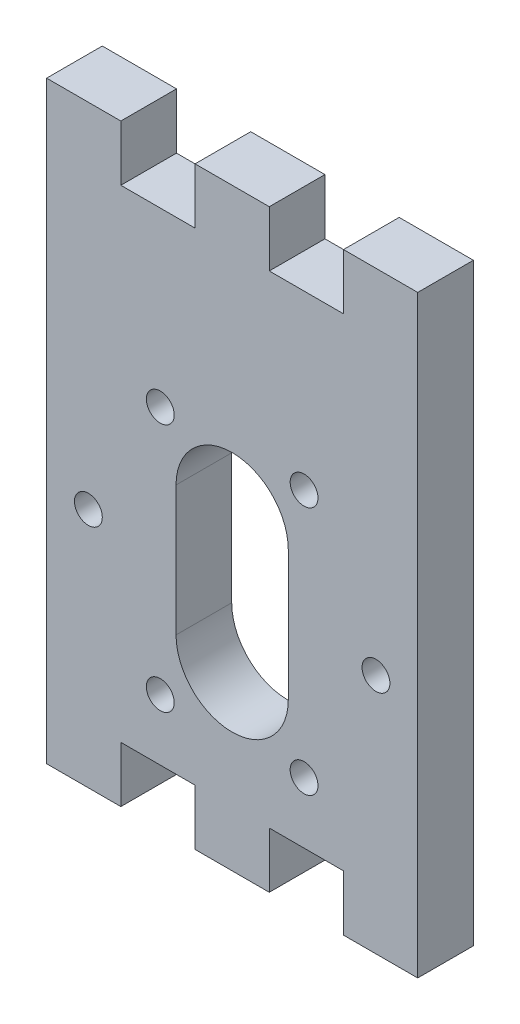
ISO-10303-21;
HEADER;
FILE_DESCRIPTION(('STEP AP214'),'2;1');
FILE_NAME('part.step','',(''),(''),'','','');
FILE_SCHEMA(('AUTOMOTIVE_DESIGN { 1 0 10303 214 1 1 1 1 }'));
ENDSEC;
DATA;
#1=APPLICATION_CONTEXT('core data for automotive mechanical design processes');
#2=APPLICATION_PROTOCOL_DEFINITION('international standard','automotive_design',2000,#1);
#3=PRODUCT_CONTEXT('',#1,'mechanical');
#4=PRODUCT('Part','Part','',(#3));
#5=PRODUCT_RELATED_PRODUCT_CATEGORY('part','',(#4));
#6=PRODUCT_DEFINITION_FORMATION('','',#4);
#7=PRODUCT_DEFINITION_CONTEXT('part definition',#1,'design');
#8=PRODUCT_DEFINITION('design','',#6,#7);
#9=PRODUCT_DEFINITION_SHAPE('','',#8);
#10=(LENGTH_UNIT() NAMED_UNIT(*) SI_UNIT(.MILLI.,.METRE.));
#11=(NAMED_UNIT(*) PLANE_ANGLE_UNIT() SI_UNIT($,.RADIAN.));
#12=(NAMED_UNIT(*) SI_UNIT($,.STERADIAN.) SOLID_ANGLE_UNIT());
#13=UNCERTAINTY_MEASURE_WITH_UNIT(LENGTH_MEASURE(1.E-05),#10,'distance_accuracy_value','');
#14=(GEOMETRIC_REPRESENTATION_CONTEXT(3) GLOBAL_UNCERTAINTY_ASSIGNED_CONTEXT((#13)) GLOBAL_UNIT_ASSIGNED_CONTEXT((#10,
#11,#12)) REPRESENTATION_CONTEXT('',''));
#15=CARTESIAN_POINT('',(0.,0.,0.));
#16=DIRECTION('',(0.,0.,1.));
#17=DIRECTION('',(1.,0.,0.));
#18=AXIS2_PLACEMENT_3D('',#15,#16,#17);
#19=CARTESIAN_POINT('',(0.,0.,6.));
#20=DIRECTION('',(0.,0.,-1.));
#21=DIRECTION('',(-1.,0.,0.));
#22=AXIS2_PLACEMENT_3D('',#19,#20,#21);
#23=PLANE('',#22);
#24=CARTESIAN_POINT('',(7.74999999999987,6.57660624134113,6.));
#25=DIRECTION('',(0.,0.,1.));
#26=DIRECTION('',(1.,0.,0.));
#27=AXIS2_PLACEMENT_3D('',#24,#25,#26);
#28=CIRCLE('',#27,1.5);
#29=CARTESIAN_POINT('',(9.24999999999987,6.57660624134113,6.));
#30=VERTEX_POINT('',#29);
#31=EDGE_CURVE('E762',#30,#30,#28,.T.);
#32=ORIENTED_EDGE('',*,*,#31,.F.);
#33=EDGE_LOOP('',(#32));
#34=FACE_BOUND('',#33,.T.);
#35=CARTESIAN_POINT('',(7.75000000000006,33.4233937586588,6.));
#36=DIRECTION('',(0.,0.,1.));
#37=DIRECTION('',(1.,0.,0.));
#38=AXIS2_PLACEMENT_3D('',#35,#36,#37);
#39=CIRCLE('',#38,1.5);
#40=CARTESIAN_POINT('',(9.25000000000006,33.4233937586588,6.));
#41=VERTEX_POINT('',#40);
#42=EDGE_CURVE('E774',#41,#41,#39,.T.);
#43=ORIENTED_EDGE('',*,*,#42,.F.);
#44=EDGE_LOOP('',(#43));
#45=FACE_BOUND('',#44,.T.);
#46=CARTESIAN_POINT('',(0.,27.,6.));
#47=DIRECTION('',(0.,0.,1.));
#48=DIRECTION('',(1.,0.,0.));
#49=AXIS2_PLACEMENT_3D('',#46,#47,#48);
#50=CIRCLE('',#49,6.05);
#51=CARTESIAN_POINT('',(6.05,27.,6.));
#52=VERTEX_POINT('',#51);
#53=CARTESIAN_POINT('',(-6.05,27.,6.));
#54=VERTEX_POINT('',#53);
#55=EDGE_CURVE('E193',#52,#54,#50,.T.);
#56=ORIENTED_EDGE('',*,*,#55,.F.);
#57=DIRECTION('',(0.,1.,0.));
#58=VECTOR('',#57,1.);
#59=CARTESIAN_POINT('',(6.05,13.,6.));
#60=LINE('',#59,#58);
#61=CARTESIAN_POINT('',(6.05,13.,6.));
#62=VERTEX_POINT('',#61);
#63=EDGE_CURVE('E216',#62,#52,#60,.T.);
#64=ORIENTED_EDGE('',*,*,#63,.F.);
#65=CARTESIAN_POINT('',(0.,13.,6.));
#66=DIRECTION('',(0.,0.,1.));
#67=DIRECTION('',(1.,0.,0.));
#68=AXIS2_PLACEMENT_3D('',#65,#66,#67);
#69=CIRCLE('',#68,6.05);
#70=CARTESIAN_POINT('',(-6.05,13.,6.));
#71=VERTEX_POINT('',#70);
#72=EDGE_CURVE('E214',#71,#62,#69,.T.);
#73=ORIENTED_EDGE('',*,*,#72,.F.);
#74=DIRECTION('',(0.,-1.,0.));
#75=VECTOR('',#74,1.);
#76=CARTESIAN_POINT('',(-6.05,27.,6.));
#77=LINE('',#76,#75);
#78=EDGE_CURVE('E201',#54,#71,#77,.T.);
#79=ORIENTED_EDGE('',*,*,#78,.F.);
#80=EDGE_LOOP('',(#56,#64,#73,#79));
#81=FACE_BOUND('',#80,.T.);
#82=DIRECTION('',(0.,-1.,0.));
#83=VECTOR('',#82,1.);
#84=CARTESIAN_POINT('',(-20.,-6.,6.));
#85=LINE('',#84,#83);
#86=CARTESIAN_POINT('',(-20.,58.,6.));
#87=VERTEX_POINT('',#86);
#88=CARTESIAN_POINT('',(-20.,-6.,6.));
#89=VERTEX_POINT('',#88);
#90=EDGE_CURVE('E238',#87,#89,#85,.T.);
#91=ORIENTED_EDGE('',*,*,#90,.T.);
#92=DIRECTION('',(1.,0.,0.));
#93=VECTOR('',#92,1.);
#94=CARTESIAN_POINT('',(-20.,-6.,6.));
#95=LINE('',#94,#93);
#96=CARTESIAN_POINT('',(-12.,-6.,6.));
#97=VERTEX_POINT('',#96);
#98=EDGE_CURVE('E241',#89,#97,#95,.T.);
#99=ORIENTED_EDGE('',*,*,#98,.T.);
#100=DIRECTION('',(0.,1.,0.));
#101=VECTOR('',#100,1.);
#102=CARTESIAN_POINT('',(-12.,0.,6.));
#103=LINE('',#102,#101);
#104=CARTESIAN_POINT('',(-12.,0.,6.));
#105=VERTEX_POINT('',#104);
#106=EDGE_CURVE('E244',#97,#105,#103,.T.);
#107=ORIENTED_EDGE('',*,*,#106,.T.);
#108=DIRECTION('',(1.,0.,0.));
#109=VECTOR('',#108,1.);
#110=CARTESIAN_POINT('',(-12.,0.,6.));
#111=LINE('',#110,#109);
#112=CARTESIAN_POINT('',(-4.,0.,6.));
#113=VERTEX_POINT('',#112);
#114=EDGE_CURVE('E246',#105,#113,#111,.T.);
#115=ORIENTED_EDGE('',*,*,#114,.T.);
#116=DIRECTION('',(0.,-1.,0.));
#117=VECTOR('',#116,1.);
#118=CARTESIAN_POINT('',(-4.,0.,6.));
#119=LINE('',#118,#117);
#120=CARTESIAN_POINT('',(-4.,-6.,6.));
#121=VERTEX_POINT('',#120);
#122=EDGE_CURVE('E248',#113,#121,#119,.T.);
#123=ORIENTED_EDGE('',*,*,#122,.T.);
#124=DIRECTION('',(1.,0.,0.));
#125=VECTOR('',#124,1.);
#126=CARTESIAN_POINT('',(4.,-6.,6.));
#127=LINE('',#126,#125);
#128=CARTESIAN_POINT('',(4.,-6.,6.));
#129=VERTEX_POINT('',#128);
#130=EDGE_CURVE('E250',#121,#129,#127,.T.);
#131=ORIENTED_EDGE('',*,*,#130,.T.);
#132=DIRECTION('',(0.,1.,0.));
#133=VECTOR('',#132,1.);
#134=CARTESIAN_POINT('',(4.,0.,6.));
#135=LINE('',#134,#133);
#136=CARTESIAN_POINT('',(4.,0.,6.));
#137=VERTEX_POINT('',#136);
#138=EDGE_CURVE('E252',#129,#137,#135,.T.);
#139=ORIENTED_EDGE('',*,*,#138,.T.);
#140=DIRECTION('',(1.,0.,0.));
#141=VECTOR('',#140,1.);
#142=CARTESIAN_POINT('',(4.,0.,6.));
#143=LINE('',#142,#141);
#144=CARTESIAN_POINT('',(12.,0.,6.));
#145=VERTEX_POINT('',#144);
#146=EDGE_CURVE('E254',#137,#145,#143,.T.);
#147=ORIENTED_EDGE('',*,*,#146,.T.);
#148=DIRECTION('',(0.,-1.,0.));
#149=VECTOR('',#148,1.);
#150=CARTESIAN_POINT('',(12.,0.,6.));
#151=LINE('',#150,#149);
#152=CARTESIAN_POINT('',(12.,-6.,6.));
#153=VERTEX_POINT('',#152);
#154=EDGE_CURVE('E256',#145,#153,#151,.T.);
#155=ORIENTED_EDGE('',*,*,#154,.T.);
#156=DIRECTION('',(1.,0.,0.));
#157=VECTOR('',#156,1.);
#158=CARTESIAN_POINT('',(20.,-6.,6.));
#159=LINE('',#158,#157);
#160=CARTESIAN_POINT('',(20.,-6.,6.));
#161=VERTEX_POINT('',#160);
#162=EDGE_CURVE('E258',#153,#161,#159,.T.);
#163=ORIENTED_EDGE('',*,*,#162,.T.);
#164=DIRECTION('',(0.,1.,0.));
#165=VECTOR('',#164,1.);
#166=CARTESIAN_POINT('',(20.,-0.999999999999998,6.));
#167=LINE('',#166,#165);
#168=CARTESIAN_POINT('',(20.,58.,6.));
#169=VERTEX_POINT('',#168);
#170=EDGE_CURVE('E260',#161,#169,#167,.T.);
#171=ORIENTED_EDGE('',*,*,#170,.T.);
#172=DIRECTION('',(-1.,0.,0.));
#173=VECTOR('',#172,1.);
#174=CARTESIAN_POINT('',(12.,58.,6.));
#175=LINE('',#174,#173);
#176=CARTESIAN_POINT('',(12.,58.,6.));
#177=VERTEX_POINT('',#176);
#178=EDGE_CURVE('E262',#169,#177,#175,.T.);
#179=ORIENTED_EDGE('',*,*,#178,.T.);
#180=DIRECTION('',(0.,-1.,0.));
#181=VECTOR('',#180,1.);
#182=CARTESIAN_POINT('',(12.,58.,6.));
#183=LINE('',#182,#181);
#184=CARTESIAN_POINT('',(12.,52.,6.));
#185=VERTEX_POINT('',#184);
#186=EDGE_CURVE('E264',#177,#185,#183,.T.);
#187=ORIENTED_EDGE('',*,*,#186,.T.);
#188=DIRECTION('',(-1.,0.,0.));
#189=VECTOR('',#188,1.);
#190=CARTESIAN_POINT('',(3.99999999999999,52.,6.));
#191=LINE('',#190,#189);
#192=CARTESIAN_POINT('',(3.99999999999999,52.,6.));
#193=VERTEX_POINT('',#192);
#194=EDGE_CURVE('E266',#185,#193,#191,.T.);
#195=ORIENTED_EDGE('',*,*,#194,.T.);
#196=DIRECTION('',(0.,1.,0.));
#197=VECTOR('',#196,1.);
#198=CARTESIAN_POINT('',(3.99999999999999,58.,6.));
#199=LINE('',#198,#197);
#200=CARTESIAN_POINT('',(3.99999999999999,58.,6.));
#201=VERTEX_POINT('',#200);
#202=EDGE_CURVE('E268',#193,#201,#199,.T.);
#203=ORIENTED_EDGE('',*,*,#202,.T.);
#204=DIRECTION('',(-1.,0.,0.));
#205=VECTOR('',#204,1.);
#206=CARTESIAN_POINT('',(-4.00000000000001,58.,6.));
#207=LINE('',#206,#205);
#208=CARTESIAN_POINT('',(-4.00000000000001,58.,6.));
#209=VERTEX_POINT('',#208);
#210=EDGE_CURVE('E270',#201,#209,#207,.T.);
#211=ORIENTED_EDGE('',*,*,#210,.T.);
#212=DIRECTION('',(0.,-1.,0.));
#213=VECTOR('',#212,1.);
#214=CARTESIAN_POINT('',(-4.00000000000001,58.,6.));
#215=LINE('',#214,#213);
#216=CARTESIAN_POINT('',(-4.00000000000001,52.,6.));
#217=VERTEX_POINT('',#216);
#218=EDGE_CURVE('E272',#209,#217,#215,.T.);
#219=ORIENTED_EDGE('',*,*,#218,.T.);
#220=DIRECTION('',(-1.,0.,0.));
#221=VECTOR('',#220,1.);
#222=CARTESIAN_POINT('',(-12.,52.,6.));
#223=LINE('',#222,#221);
#224=CARTESIAN_POINT('',(-12.,52.,6.));
#225=VERTEX_POINT('',#224);
#226=EDGE_CURVE('E274',#217,#225,#223,.T.);
#227=ORIENTED_EDGE('',*,*,#226,.T.);
#228=DIRECTION('',(0.,1.,0.));
#229=VECTOR('',#228,1.);
#230=CARTESIAN_POINT('',(-12.,58.,6.));
#231=LINE('',#230,#229);
#232=CARTESIAN_POINT('',(-12.,58.,6.));
#233=VERTEX_POINT('',#232);
#234=EDGE_CURVE('E276',#225,#233,#231,.T.);
#235=ORIENTED_EDGE('',*,*,#234,.T.);
#236=DIRECTION('',(-1.,0.,0.));
#237=VECTOR('',#236,1.);
#238=CARTESIAN_POINT('',(-20.,58.,6.));
#239=LINE('',#238,#237);
#240=EDGE_CURVE('E278',#233,#87,#239,.T.);
#241=ORIENTED_EDGE('',*,*,#240,.T.);
#242=EDGE_LOOP('',(#91,#99,#107,#115,#123,#131,#139,#147,#155,#163,#171,#179,#187,#195,#203,
#211,#219,#227,#235,#241));
#243=FACE_BOUND('',#242,.T.);
#244=CARTESIAN_POINT('',(-15.5,20.,6.));
#245=DIRECTION('',(0.,0.,1.));
#246=DIRECTION('',(1.,0.,0.));
#247=AXIS2_PLACEMENT_3D('',#244,#245,#246);
#248=CIRCLE('',#247,1.5);
#249=CARTESIAN_POINT('',(-14.,20.,6.));
#250=VERTEX_POINT('',#249);
#251=EDGE_CURVE('E232',#250,#250,#248,.T.);
#252=ORIENTED_EDGE('',*,*,#251,.F.);
#253=EDGE_LOOP('',(#252));
#254=FACE_BOUND('',#253,.T.);
#255=CARTESIAN_POINT('',(-7.74999999999998,33.4233937586588,6.));
#256=DIRECTION('',(0.,0.,1.));
#257=DIRECTION('',(1.,0.,0.));
#258=AXIS2_PLACEMENT_3D('',#255,#256,#257);
#259=CIRCLE('',#258,1.5);
#260=CARTESIAN_POINT('',(-6.24999999999997,33.4233937586588,6.));
#261=VERTEX_POINT('',#260);
#262=EDGE_CURVE('E222',#261,#261,#259,.T.);
#263=ORIENTED_EDGE('',*,*,#262,.F.);
#264=EDGE_LOOP('',(#263));
#265=FACE_BOUND('',#264,.T.);
#266=CARTESIAN_POINT('',(15.5,19.9999999999999,6.));
#267=DIRECTION('',(0.,0.,1.));
#268=DIRECTION('',(1.,0.,0.));
#269=AXIS2_PLACEMENT_3D('',#266,#267,#268);
#270=CIRCLE('',#269,1.5);
#271=CARTESIAN_POINT('',(17.,19.9999999999999,6.));
#272=VERTEX_POINT('',#271);
#273=EDGE_CURVE('E768',#272,#272,#270,.T.);
#274=ORIENTED_EDGE('',*,*,#273,.F.);
#275=EDGE_LOOP('',(#274));
#276=FACE_BOUND('',#275,.T.);
#277=CARTESIAN_POINT('',(-7.75000000000016,6.57660624134129,6.));
#278=DIRECTION('',(0.,0.,1.));
#279=DIRECTION('',(1.,0.,0.));
#280=AXIS2_PLACEMENT_3D('',#277,#278,#279);
#281=CIRCLE('',#280,1.5);
#282=CARTESIAN_POINT('',(-6.25000000000015,6.57660624134129,6.));
#283=VERTEX_POINT('',#282);
#284=EDGE_CURVE('E753',#283,#283,#281,.T.);
#285=ORIENTED_EDGE('',*,*,#284,.F.);
#286=EDGE_LOOP('',(#285));
#287=FACE_BOUND('',#286,.T.);
#288=ADVANCED_FACE('F32',(#34,#45,#81,#243,#254,#265,#276,#287),#23,.F.);
#289=CARTESIAN_POINT('',(0.,0.,0.));
#290=DIRECTION('',(0.,0.,-1.));
#291=DIRECTION('',(-1.,0.,0.));
#292=AXIS2_PLACEMENT_3D('',#289,#290,#291);
#293=PLANE('',#292);
#294=CARTESIAN_POINT('',(7.74999999999987,6.57660624134113,0.));
#295=DIRECTION('',(0.,0.,1.));
#296=DIRECTION('',(1.,0.,0.));
#297=AXIS2_PLACEMENT_3D('',#294,#295,#296);
#298=CIRCLE('',#297,1.5);
#299=CARTESIAN_POINT('',(9.24999999999987,6.57660624134113,0.));
#300=VERTEX_POINT('',#299);
#301=EDGE_CURVE('E759',#300,#300,#298,.T.);
#302=ORIENTED_EDGE('',*,*,#301,.T.);
#303=EDGE_LOOP('',(#302));
#304=FACE_BOUND('',#303,.T.);
#305=CARTESIAN_POINT('',(7.75000000000006,33.4233937586588,0.));
#306=DIRECTION('',(0.,0.,1.));
#307=DIRECTION('',(1.,0.,0.));
#308=AXIS2_PLACEMENT_3D('',#305,#306,#307);
#309=CIRCLE('',#308,1.5);
#310=CARTESIAN_POINT('',(9.25000000000006,33.4233937586588,0.));
#311=VERTEX_POINT('',#310);
#312=EDGE_CURVE('E771',#311,#311,#309,.T.);
#313=ORIENTED_EDGE('',*,*,#312,.T.);
#314=EDGE_LOOP('',(#313));
#315=FACE_BOUND('',#314,.T.);
#316=DIRECTION('',(0.,1.,0.));
#317=VECTOR('',#316,1.);
#318=CARTESIAN_POINT('',(6.05,13.,0.));
#319=LINE('',#318,#317);
#320=CARTESIAN_POINT('',(6.05,13.,0.));
#321=VERTEX_POINT('',#320);
#322=CARTESIAN_POINT('',(6.05,27.,0.));
#323=VERTEX_POINT('',#322);
#324=EDGE_CURVE('E202',#321,#323,#319,.T.);
#325=ORIENTED_EDGE('',*,*,#324,.T.);
#326=CARTESIAN_POINT('',(0.,27.,0.));
#327=DIRECTION('',(0.,0.,1.));
#328=DIRECTION('',(1.,0.,0.));
#329=AXIS2_PLACEMENT_3D('',#326,#327,#328);
#330=CIRCLE('',#329,6.05);
#331=CARTESIAN_POINT('',(-6.05,27.,0.));
#332=VERTEX_POINT('',#331);
#333=EDGE_CURVE('E55',#323,#332,#330,.T.);
#334=ORIENTED_EDGE('',*,*,#333,.T.);
#335=DIRECTION('',(0.,-1.,0.));
#336=VECTOR('',#335,1.);
#337=CARTESIAN_POINT('',(-6.05,27.,0.));
#338=LINE('',#337,#336);
#339=CARTESIAN_POINT('',(-6.05,13.,0.));
#340=VERTEX_POINT('',#339);
#341=EDGE_CURVE('E208',#332,#340,#338,.T.);
#342=ORIENTED_EDGE('',*,*,#341,.T.);
#343=CARTESIAN_POINT('',(0.,13.,0.));
#344=DIRECTION('',(0.,0.,1.));
#345=DIRECTION('',(1.,0.,0.));
#346=AXIS2_PLACEMENT_3D('',#343,#344,#345);
#347=CIRCLE('',#346,6.05);
#348=EDGE_CURVE('E224',#340,#321,#347,.T.);
#349=ORIENTED_EDGE('',*,*,#348,.T.);
#350=EDGE_LOOP('',(#325,#334,#342,#349));
#351=FACE_BOUND('',#350,.T.);
#352=DIRECTION('',(0.,-1.,0.));
#353=VECTOR('',#352,1.);
#354=CARTESIAN_POINT('',(-20.,-6.,0.));
#355=LINE('',#354,#353);
#356=CARTESIAN_POINT('',(-20.,58.,0.));
#357=VERTEX_POINT('',#356);
#358=CARTESIAN_POINT('',(-20.,-6.,0.));
#359=VERTEX_POINT('',#358);
#360=EDGE_CURVE('E235',#357,#359,#355,.T.);
#361=ORIENTED_EDGE('',*,*,#360,.F.);
#362=DIRECTION('',(-1.,0.,0.));
#363=VECTOR('',#362,1.);
#364=CARTESIAN_POINT('',(-20.,58.,0.));
#365=LINE('',#364,#363);
#366=CARTESIAN_POINT('',(-12.,58.,0.));
#367=VERTEX_POINT('',#366);
#368=EDGE_CURVE('E242',#367,#357,#365,.T.);
#369=ORIENTED_EDGE('',*,*,#368,.F.);
#370=DIRECTION('',(0.,1.,0.));
#371=VECTOR('',#370,1.);
#372=CARTESIAN_POINT('',(-12.,58.,0.));
#373=LINE('',#372,#371);
#374=CARTESIAN_POINT('',(-12.,52.,0.));
#375=VERTEX_POINT('',#374);
#376=EDGE_CURVE('E318',#375,#367,#373,.T.);
#377=ORIENTED_EDGE('',*,*,#376,.F.);
#378=DIRECTION('',(-1.,0.,0.));
#379=VECTOR('',#378,1.);
#380=CARTESIAN_POINT('',(-12.,52.,0.));
#381=LINE('',#380,#379);
#382=CARTESIAN_POINT('',(-4.00000000000001,52.,0.));
#383=VERTEX_POINT('',#382);
#384=EDGE_CURVE('E316',#383,#375,#381,.T.);
#385=ORIENTED_EDGE('',*,*,#384,.F.);
#386=DIRECTION('',(0.,-1.,0.));
#387=VECTOR('',#386,1.);
#388=CARTESIAN_POINT('',(-4.00000000000001,58.,0.));
#389=LINE('',#388,#387);
#390=CARTESIAN_POINT('',(-4.00000000000001,58.,0.));
#391=VERTEX_POINT('',#390);
#392=EDGE_CURVE('E314',#391,#383,#389,.T.);
#393=ORIENTED_EDGE('',*,*,#392,.F.);
#394=DIRECTION('',(-1.,0.,0.));
#395=VECTOR('',#394,1.);
#396=CARTESIAN_POINT('',(-4.00000000000001,58.,0.));
#397=LINE('',#396,#395);
#398=CARTESIAN_POINT('',(3.99999999999999,58.,0.));
#399=VERTEX_POINT('',#398);
#400=EDGE_CURVE('E312',#399,#391,#397,.T.);
#401=ORIENTED_EDGE('',*,*,#400,.F.);
#402=DIRECTION('',(0.,1.,0.));
#403=VECTOR('',#402,1.);
#404=CARTESIAN_POINT('',(3.99999999999999,58.,0.));
#405=LINE('',#404,#403);
#406=CARTESIAN_POINT('',(3.99999999999999,52.,0.));
#407=VERTEX_POINT('',#406);
#408=EDGE_CURVE('E310',#407,#399,#405,.T.);
#409=ORIENTED_EDGE('',*,*,#408,.F.);
#410=DIRECTION('',(-1.,0.,0.));
#411=VECTOR('',#410,1.);
#412=CARTESIAN_POINT('',(3.99999999999999,52.,0.));
#413=LINE('',#412,#411);
#414=CARTESIAN_POINT('',(12.,52.,0.));
#415=VERTEX_POINT('',#414);
#416=EDGE_CURVE('E308',#415,#407,#413,.T.);
#417=ORIENTED_EDGE('',*,*,#416,.F.);
#418=DIRECTION('',(0.,-1.,0.));
#419=VECTOR('',#418,1.);
#420=CARTESIAN_POINT('',(12.,58.,0.));
#421=LINE('',#420,#419);
#422=CARTESIAN_POINT('',(12.,58.,0.));
#423=VERTEX_POINT('',#422);
#424=EDGE_CURVE('E306',#423,#415,#421,.T.);
#425=ORIENTED_EDGE('',*,*,#424,.F.);
#426=DIRECTION('',(-1.,0.,0.));
#427=VECTOR('',#426,1.);
#428=CARTESIAN_POINT('',(12.,58.,0.));
#429=LINE('',#428,#427);
#430=CARTESIAN_POINT('',(20.,58.,0.));
#431=VERTEX_POINT('',#430);
#432=EDGE_CURVE('E304',#431,#423,#429,.T.);
#433=ORIENTED_EDGE('',*,*,#432,.F.);
#434=DIRECTION('',(0.,1.,0.));
#435=VECTOR('',#434,1.);
#436=CARTESIAN_POINT('',(20.,58.,0.));
#437=LINE('',#436,#435);
#438=CARTESIAN_POINT('',(20.,-6.,0.));
#439=VERTEX_POINT('',#438);
#440=EDGE_CURVE('E302',#439,#431,#437,.T.);
#441=ORIENTED_EDGE('',*,*,#440,.F.);
#442=DIRECTION('',(1.,0.,0.));
#443=VECTOR('',#442,1.);
#444=CARTESIAN_POINT('',(20.,-6.,0.));
#445=LINE('',#444,#443);
#446=CARTESIAN_POINT('',(12.,-6.,0.));
#447=VERTEX_POINT('',#446);
#448=EDGE_CURVE('E299',#447,#439,#445,.T.);
#449=ORIENTED_EDGE('',*,*,#448,.F.);
#450=DIRECTION('',(0.,-1.,0.));
#451=VECTOR('',#450,1.);
#452=CARTESIAN_POINT('',(12.,0.,0.));
#453=LINE('',#452,#451);
#454=CARTESIAN_POINT('',(12.,0.,0.));
#455=VERTEX_POINT('',#454);
#456=EDGE_CURVE('E297',#455,#447,#453,.T.);
#457=ORIENTED_EDGE('',*,*,#456,.F.);
#458=DIRECTION('',(1.,0.,0.));
#459=VECTOR('',#458,1.);
#460=CARTESIAN_POINT('',(4.,0.,0.));
#461=LINE('',#460,#459);
#462=CARTESIAN_POINT('',(4.,0.,0.));
#463=VERTEX_POINT('',#462);
#464=EDGE_CURVE('E295',#463,#455,#461,.T.);
#465=ORIENTED_EDGE('',*,*,#464,.F.);
#466=DIRECTION('',(0.,1.,0.));
#467=VECTOR('',#466,1.);
#468=CARTESIAN_POINT('',(4.,0.,0.));
#469=LINE('',#468,#467);
#470=CARTESIAN_POINT('',(4.,-6.,0.));
#471=VERTEX_POINT('',#470);
#472=EDGE_CURVE('E293',#471,#463,#469,.T.);
#473=ORIENTED_EDGE('',*,*,#472,.F.);
#474=DIRECTION('',(1.,0.,0.));
#475=VECTOR('',#474,1.);
#476=CARTESIAN_POINT('',(4.,-6.,0.));
#477=LINE('',#476,#475);
#478=CARTESIAN_POINT('',(-4.,-6.,0.));
#479=VERTEX_POINT('',#478);
#480=EDGE_CURVE('E291',#479,#471,#477,.T.);
#481=ORIENTED_EDGE('',*,*,#480,.F.);
#482=DIRECTION('',(0.,-1.,0.));
#483=VECTOR('',#482,1.);
#484=CARTESIAN_POINT('',(-4.,0.,0.));
#485=LINE('',#484,#483);
#486=CARTESIAN_POINT('',(-4.,0.,0.));
#487=VERTEX_POINT('',#486);
#488=EDGE_CURVE('E289',#487,#479,#485,.T.);
#489=ORIENTED_EDGE('',*,*,#488,.F.);
#490=DIRECTION('',(1.,0.,0.));
#491=VECTOR('',#490,1.);
#492=CARTESIAN_POINT('',(-12.,0.,0.));
#493=LINE('',#492,#491);
#494=CARTESIAN_POINT('',(-12.,0.,0.));
#495=VERTEX_POINT('',#494);
#496=EDGE_CURVE('E287',#495,#487,#493,.T.);
#497=ORIENTED_EDGE('',*,*,#496,.F.);
#498=DIRECTION('',(0.,1.,0.));
#499=VECTOR('',#498,1.);
#500=CARTESIAN_POINT('',(-12.,0.,0.));
#501=LINE('',#500,#499);
#502=CARTESIAN_POINT('',(-12.,-6.,0.));
#503=VERTEX_POINT('',#502);
#504=EDGE_CURVE('E285',#503,#495,#501,.T.);
#505=ORIENTED_EDGE('',*,*,#504,.F.);
#506=DIRECTION('',(1.,0.,0.));
#507=VECTOR('',#506,1.);
#508=CARTESIAN_POINT('',(-20.,-6.,0.));
#509=LINE('',#508,#507);
#510=EDGE_CURVE('E283',#359,#503,#509,.T.);
#511=ORIENTED_EDGE('',*,*,#510,.F.);
#512=EDGE_LOOP('',(#361,#369,#377,#385,#393,#401,#409,#417,#425,#433,#441,#449,#457,#465,#473,
#481,#489,#497,#505,#511));
#513=FACE_BOUND('',#512,.T.);
#514=CARTESIAN_POINT('',(-15.5,20.,0.));
#515=DIRECTION('',(0.,0.,1.));
#516=DIRECTION('',(1.,0.,0.));
#517=AXIS2_PLACEMENT_3D('',#514,#515,#516);
#518=CIRCLE('',#517,1.5);
#519=CARTESIAN_POINT('',(-14.,20.,0.));
#520=VERTEX_POINT('',#519);
#521=EDGE_CURVE('E209',#520,#520,#518,.T.);
#522=ORIENTED_EDGE('',*,*,#521,.T.);
#523=EDGE_LOOP('',(#522));
#524=FACE_BOUND('',#523,.T.);
#525=CARTESIAN_POINT('',(-7.74999999999998,33.4233937586588,0.));
#526=DIRECTION('',(0.,0.,1.));
#527=DIRECTION('',(1.,0.,0.));
#528=AXIS2_PLACEMENT_3D('',#525,#526,#527);
#529=CIRCLE('',#528,1.5);
#530=CARTESIAN_POINT('',(-6.24999999999997,33.4233937586588,0.));
#531=VERTEX_POINT('',#530);
#532=EDGE_CURVE('E777',#531,#531,#529,.T.);
#533=ORIENTED_EDGE('',*,*,#532,.T.);
#534=EDGE_LOOP('',(#533));
#535=FACE_BOUND('',#534,.T.);
#536=CARTESIAN_POINT('',(15.5,19.9999999999999,0.));
#537=DIRECTION('',(0.,0.,1.));
#538=DIRECTION('',(1.,0.,0.));
#539=AXIS2_PLACEMENT_3D('',#536,#537,#538);
#540=CIRCLE('',#539,1.5);
#541=CARTESIAN_POINT('',(17.,19.9999999999999,0.));
#542=VERTEX_POINT('',#541);
#543=EDGE_CURVE('E765',#542,#542,#540,.T.);
#544=ORIENTED_EDGE('',*,*,#543,.T.);
#545=EDGE_LOOP('',(#544));
#546=FACE_BOUND('',#545,.T.);
#547=CARTESIAN_POINT('',(-7.75000000000016,6.57660624134129,0.));
#548=DIRECTION('',(0.,0.,1.));
#549=DIRECTION('',(1.,0.,0.));
#550=AXIS2_PLACEMENT_3D('',#547,#548,#549);
#551=CIRCLE('',#550,1.5);
#552=CARTESIAN_POINT('',(-6.25000000000015,6.57660624134129,0.));
#553=VERTEX_POINT('',#552);
#554=EDGE_CURVE('E756',#553,#553,#551,.T.);
#555=ORIENTED_EDGE('',*,*,#554,.T.);
#556=EDGE_LOOP('',(#555));
#557=FACE_BOUND('',#556,.T.);
#558=ADVANCED_FACE('F384',(#304,#315,#351,#513,#524,#535,#546,#557),#293,.T.);
#559=CARTESIAN_POINT('',(-20.,-6.,6.));
#560=DIRECTION('',(1.,0.,0.));
#561=DIRECTION('',(0.,0.,-1.));
#562=AXIS2_PLACEMENT_3D('',#559,#560,#561);
#563=PLANE('',#562);
#564=ORIENTED_EDGE('',*,*,#360,.T.);
#565=DIRECTION('',(0.,0.,-1.));
#566=VECTOR('',#565,1.);
#567=CARTESIAN_POINT('',(-20.,-6.,6.));
#568=LINE('',#567,#566);
#569=EDGE_CURVE('E11',#89,#359,#568,.T.);
#570=ORIENTED_EDGE('',*,*,#569,.F.);
#571=ORIENTED_EDGE('',*,*,#90,.F.);
#572=DIRECTION('',(0.,0.,-1.));
#573=VECTOR('',#572,1.);
#574=CARTESIAN_POINT('',(-20.,58.,6.));
#575=LINE('',#574,#573);
#576=EDGE_CURVE('E280',#87,#357,#575,.T.);
#577=ORIENTED_EDGE('',*,*,#576,.T.);
#578=EDGE_LOOP('',(#564,#570,#571,#577));
#579=FACE_BOUND('',#578,.T.);
#580=ADVANCED_FACE('F34',(#579),#563,.F.);
#581=CARTESIAN_POINT('',(-20.,-6.,6.));
#582=DIRECTION('',(0.,1.,0.));
#583=DIRECTION('',(-1.,0.,0.));
#584=AXIS2_PLACEMENT_3D('',#581,#582,#583);
#585=PLANE('',#584);
#586=ORIENTED_EDGE('',*,*,#510,.T.);
#587=DIRECTION('',(0.,0.,-1.));
#588=VECTOR('',#587,1.);
#589=CARTESIAN_POINT('',(-12.,-6.,6.));
#590=LINE('',#589,#588);
#591=EDGE_CURVE('E40',#97,#503,#590,.T.);
#592=ORIENTED_EDGE('',*,*,#591,.F.);
#593=ORIENTED_EDGE('',*,*,#98,.F.);
#594=ORIENTED_EDGE('',*,*,#569,.T.);
#595=EDGE_LOOP('',(#586,#592,#593,#594));
#596=FACE_BOUND('',#595,.T.);
#597=ADVANCED_FACE('F401',(#596),#585,.F.);
#598=CARTESIAN_POINT('',(-12.,0.,6.));
#599=DIRECTION('',(-1.,0.,0.));
#600=DIRECTION('',(0.,0.,1.));
#601=AXIS2_PLACEMENT_3D('',#598,#599,#600);
#602=PLANE('',#601);
#603=ORIENTED_EDGE('',*,*,#504,.T.);
#604=DIRECTION('',(0.,0.,-1.));
#605=VECTOR('',#604,1.);
#606=CARTESIAN_POINT('',(-12.,0.,6.));
#607=LINE('',#606,#605);
#608=EDGE_CURVE('E371',#105,#495,#607,.T.);
#609=ORIENTED_EDGE('',*,*,#608,.F.);
#610=ORIENTED_EDGE('',*,*,#106,.F.);
#611=ORIENTED_EDGE('',*,*,#591,.T.);
#612=EDGE_LOOP('',(#603,#609,#610,#611));
#613=FACE_BOUND('',#612,.T.);
#614=ADVANCED_FACE('F378',(#613),#602,.F.);
#615=CARTESIAN_POINT('',(-12.,0.,6.));
#616=DIRECTION('',(0.,1.,0.));
#617=DIRECTION('',(-1.,0.,0.));
#618=AXIS2_PLACEMENT_3D('',#615,#616,#617);
#619=PLANE('',#618);
#620=ORIENTED_EDGE('',*,*,#496,.T.);
#621=DIRECTION('',(0.,0.,-1.));
#622=VECTOR('',#621,1.);
#623=CARTESIAN_POINT('',(-4.,0.,6.));
#624=LINE('',#623,#622);
#625=EDGE_CURVE('E368',#113,#487,#624,.T.);
#626=ORIENTED_EDGE('',*,*,#625,.F.);
#627=ORIENTED_EDGE('',*,*,#114,.F.);
#628=ORIENTED_EDGE('',*,*,#608,.T.);
#629=EDGE_LOOP('',(#620,#626,#627,#628));
#630=FACE_BOUND('',#629,.T.);
#631=ADVANCED_FACE('F390',(#630),#619,.F.);
#632=CARTESIAN_POINT('',(-4.,0.,6.));
#633=DIRECTION('',(1.,0.,0.));
#634=DIRECTION('',(0.,1.,0.));
#635=AXIS2_PLACEMENT_3D('',#632,#633,#634);
#636=PLANE('',#635);
#637=ORIENTED_EDGE('',*,*,#488,.T.);
#638=DIRECTION('',(0.,0.,-1.));
#639=VECTOR('',#638,1.);
#640=CARTESIAN_POINT('',(-4.,-6.,6.));
#641=LINE('',#640,#639);
#642=EDGE_CURVE('E365',#121,#479,#641,.T.);
#643=ORIENTED_EDGE('',*,*,#642,.F.);
#644=ORIENTED_EDGE('',*,*,#122,.F.);
#645=ORIENTED_EDGE('',*,*,#625,.T.);
#646=EDGE_LOOP('',(#637,#643,#644,#645));
#647=FACE_BOUND('',#646,.T.);
#648=ADVANCED_FACE('F394',(#647),#636,.F.);
#649=CARTESIAN_POINT('',(4.,-6.,6.));
#650=DIRECTION('',(0.,1.,0.));
#651=DIRECTION('',(-1.,0.,0.));
#652=AXIS2_PLACEMENT_3D('',#649,#650,#651);
#653=PLANE('',#652);
#654=ORIENTED_EDGE('',*,*,#480,.T.);
#655=DIRECTION('',(0.,0.,-1.));
#656=VECTOR('',#655,1.);
#657=CARTESIAN_POINT('',(4.,-6.,6.));
#658=LINE('',#657,#656);
#659=EDGE_CURVE('E362',#129,#471,#658,.T.);
#660=ORIENTED_EDGE('',*,*,#659,.F.);
#661=ORIENTED_EDGE('',*,*,#130,.F.);
#662=ORIENTED_EDGE('',*,*,#642,.T.);
#663=EDGE_LOOP('',(#654,#660,#661,#662));
#664=FACE_BOUND('',#663,.T.);
#665=ADVANCED_FACE('F473',(#664),#653,.F.);
#666=CARTESIAN_POINT('',(4.,0.,6.));
#667=DIRECTION('',(-1.,0.,0.));
#668=DIRECTION('',(0.,-1.,0.));
#669=AXIS2_PLACEMENT_3D('',#666,#667,#668);
#670=PLANE('',#669);
#671=ORIENTED_EDGE('',*,*,#472,.T.);
#672=DIRECTION('',(0.,0.,-1.));
#673=VECTOR('',#672,1.);
#674=CARTESIAN_POINT('',(4.,0.,6.));
#675=LINE('',#674,#673);
#676=EDGE_CURVE('E359',#137,#463,#675,.T.);
#677=ORIENTED_EDGE('',*,*,#676,.F.);
#678=ORIENTED_EDGE('',*,*,#138,.F.);
#679=ORIENTED_EDGE('',*,*,#659,.T.);
#680=EDGE_LOOP('',(#671,#677,#678,#679));
#681=FACE_BOUND('',#680,.T.);
#682=ADVANCED_FACE('F471',(#681),#670,.F.);
#683=CARTESIAN_POINT('',(4.,0.,6.));
#684=DIRECTION('',(0.,1.,0.));
#685=DIRECTION('',(-1.,0.,0.));
#686=AXIS2_PLACEMENT_3D('',#683,#684,#685);
#687=PLANE('',#686);
#688=ORIENTED_EDGE('',*,*,#464,.T.);
#689=DIRECTION('',(0.,0.,-1.));
#690=VECTOR('',#689,1.);
#691=CARTESIAN_POINT('',(12.,0.,6.));
#692=LINE('',#691,#690);
#693=EDGE_CURVE('E356',#145,#455,#692,.T.);
#694=ORIENTED_EDGE('',*,*,#693,.F.);
#695=ORIENTED_EDGE('',*,*,#146,.F.);
#696=ORIENTED_EDGE('',*,*,#676,.T.);
#697=EDGE_LOOP('',(#688,#694,#695,#696));
#698=FACE_BOUND('',#697,.T.);
#699=ADVANCED_FACE('F467',(#698),#687,.F.);
#700=CARTESIAN_POINT('',(12.,0.,6.));
#701=DIRECTION('',(1.,0.,0.));
#702=DIRECTION('',(0.,1.,0.));
#703=AXIS2_PLACEMENT_3D('',#700,#701,#702);
#704=PLANE('',#703);
#705=ORIENTED_EDGE('',*,*,#456,.T.);
#706=DIRECTION('',(0.,0.,-1.));
#707=VECTOR('',#706,1.);
#708=CARTESIAN_POINT('',(12.,-6.,6.));
#709=LINE('',#708,#707);
#710=EDGE_CURVE('E353',#153,#447,#709,.T.);
#711=ORIENTED_EDGE('',*,*,#710,.F.);
#712=ORIENTED_EDGE('',*,*,#154,.F.);
#713=ORIENTED_EDGE('',*,*,#693,.T.);
#714=EDGE_LOOP('',(#705,#711,#712,#713));
#715=FACE_BOUND('',#714,.T.);
#716=ADVANCED_FACE('F463',(#715),#704,.F.);
#717=CARTESIAN_POINT('',(20.,-6.,6.));
#718=DIRECTION('',(0.,1.,0.));
#719=DIRECTION('',(-1.,0.,0.));
#720=AXIS2_PLACEMENT_3D('',#717,#718,#719);
#721=PLANE('',#720);
#722=ORIENTED_EDGE('',*,*,#448,.T.);
#723=DIRECTION('',(0.,0.,-1.));
#724=VECTOR('',#723,1.);
#725=CARTESIAN_POINT('',(20.,-6.,6.));
#726=LINE('',#725,#724);
#727=EDGE_CURVE('E350',#161,#439,#726,.T.);
#728=ORIENTED_EDGE('',*,*,#727,.F.);
#729=ORIENTED_EDGE('',*,*,#162,.F.);
#730=ORIENTED_EDGE('',*,*,#710,.T.);
#731=EDGE_LOOP('',(#722,#728,#729,#730));
#732=FACE_BOUND('',#731,.T.);
#733=ADVANCED_FACE('F454',(#732),#721,.F.);
#734=CARTESIAN_POINT('',(20.,58.,6.));
#735=DIRECTION('',(-1.,0.,0.));
#736=DIRECTION('',(0.,-1.,0.));
#737=AXIS2_PLACEMENT_3D('',#734,#735,#736);
#738=PLANE('',#737);
#739=ORIENTED_EDGE('',*,*,#440,.T.);
#740=DIRECTION('',(0.,0.,-1.));
#741=VECTOR('',#740,1.);
#742=CARTESIAN_POINT('',(20.,58.,6.));
#743=LINE('',#742,#741);
#744=EDGE_CURVE('E347',#169,#431,#743,.T.);
#745=ORIENTED_EDGE('',*,*,#744,.F.);
#746=ORIENTED_EDGE('',*,*,#170,.F.);
#747=ORIENTED_EDGE('',*,*,#727,.T.);
#748=EDGE_LOOP('',(#739,#745,#746,#747));
#749=FACE_BOUND('',#748,.T.);
#750=ADVANCED_FACE('F458',(#749),#738,.F.);
#751=CARTESIAN_POINT('',(12.,58.,6.));
#752=DIRECTION('',(0.,-1.,0.));
#753=DIRECTION('',(0.,0.,-1.));
#754=AXIS2_PLACEMENT_3D('',#751,#752,#753);
#755=PLANE('',#754);
#756=ORIENTED_EDGE('',*,*,#432,.T.);
#757=DIRECTION('',(0.,0.,-1.));
#758=VECTOR('',#757,1.);
#759=CARTESIAN_POINT('',(12.,58.,6.));
#760=LINE('',#759,#758);
#761=EDGE_CURVE('E344',#177,#423,#760,.T.);
#762=ORIENTED_EDGE('',*,*,#761,.F.);
#763=ORIENTED_EDGE('',*,*,#178,.F.);
#764=ORIENTED_EDGE('',*,*,#744,.T.);
#765=EDGE_LOOP('',(#756,#762,#763,#764));
#766=FACE_BOUND('',#765,.T.);
#767=ADVANCED_FACE('F447',(#766),#755,.F.);
#768=CARTESIAN_POINT('',(12.,58.,6.));
#769=DIRECTION('',(1.,0.,0.));
#770=DIRECTION('',(0.,0.,-1.));
#771=AXIS2_PLACEMENT_3D('',#768,#769,#770);
#772=PLANE('',#771);
#773=ORIENTED_EDGE('',*,*,#424,.T.);
#774=DIRECTION('',(0.,0.,-1.));
#775=VECTOR('',#774,1.);
#776=CARTESIAN_POINT('',(12.,52.,6.));
#777=LINE('',#776,#775);
#778=EDGE_CURVE('E341',#185,#415,#777,.T.);
#779=ORIENTED_EDGE('',*,*,#778,.F.);
#780=ORIENTED_EDGE('',*,*,#186,.F.);
#781=ORIENTED_EDGE('',*,*,#761,.T.);
#782=EDGE_LOOP('',(#773,#779,#780,#781));
#783=FACE_BOUND('',#782,.T.);
#784=ADVANCED_FACE('F443',(#783),#772,.F.);
#785=CARTESIAN_POINT('',(3.99999999999999,52.,6.));
#786=DIRECTION('',(0.,-1.,0.));
#787=DIRECTION('',(0.,0.,-1.));
#788=AXIS2_PLACEMENT_3D('',#785,#786,#787);
#789=PLANE('',#788);
#790=ORIENTED_EDGE('',*,*,#416,.T.);
#791=DIRECTION('',(0.,0.,-1.));
#792=VECTOR('',#791,1.);
#793=CARTESIAN_POINT('',(3.99999999999999,52.,6.));
#794=LINE('',#793,#792);
#795=EDGE_CURVE('E338',#193,#407,#794,.T.);
#796=ORIENTED_EDGE('',*,*,#795,.F.);
#797=ORIENTED_EDGE('',*,*,#194,.F.);
#798=ORIENTED_EDGE('',*,*,#778,.T.);
#799=EDGE_LOOP('',(#790,#796,#797,#798));
#800=FACE_BOUND('',#799,.T.);
#801=ADVANCED_FACE('F438',(#800),#789,.F.);
#802=CARTESIAN_POINT('',(3.99999999999999,58.,6.));
#803=DIRECTION('',(-1.,0.,0.));
#804=DIRECTION('',(0.,0.,1.));
#805=AXIS2_PLACEMENT_3D('',#802,#803,#804);
#806=PLANE('',#805);
#807=ORIENTED_EDGE('',*,*,#408,.T.);
#808=DIRECTION('',(0.,0.,-1.));
#809=VECTOR('',#808,1.);
#810=CARTESIAN_POINT('',(3.99999999999999,58.,6.));
#811=LINE('',#810,#809);
#812=EDGE_CURVE('E335',#201,#399,#811,.T.);
#813=ORIENTED_EDGE('',*,*,#812,.F.);
#814=ORIENTED_EDGE('',*,*,#202,.F.);
#815=ORIENTED_EDGE('',*,*,#795,.T.);
#816=EDGE_LOOP('',(#807,#813,#814,#815));
#817=FACE_BOUND('',#816,.T.);
#818=ADVANCED_FACE('F432',(#817),#806,.F.);
#819=CARTESIAN_POINT('',(-4.00000000000001,58.,6.));
#820=DIRECTION('',(0.,-1.,0.));
#821=DIRECTION('',(0.,0.,-1.));
#822=AXIS2_PLACEMENT_3D('',#819,#820,#821);
#823=PLANE('',#822);
#824=ORIENTED_EDGE('',*,*,#400,.T.);
#825=DIRECTION('',(0.,0.,-1.));
#826=VECTOR('',#825,1.);
#827=CARTESIAN_POINT('',(-4.00000000000001,58.,6.));
#828=LINE('',#827,#826);
#829=EDGE_CURVE('E332',#209,#391,#828,.T.);
#830=ORIENTED_EDGE('',*,*,#829,.F.);
#831=ORIENTED_EDGE('',*,*,#210,.F.);
#832=ORIENTED_EDGE('',*,*,#812,.T.);
#833=EDGE_LOOP('',(#824,#830,#831,#832));
#834=FACE_BOUND('',#833,.T.);
#835=ADVANCED_FACE('F428',(#834),#823,.F.);
#836=CARTESIAN_POINT('',(-4.00000000000001,58.,6.));
#837=DIRECTION('',(1.,0.,0.));
#838=DIRECTION('',(0.,0.,-1.));
#839=AXIS2_PLACEMENT_3D('',#836,#837,#838);
#840=PLANE('',#839);
#841=ORIENTED_EDGE('',*,*,#392,.T.);
#842=DIRECTION('',(0.,0.,-1.));
#843=VECTOR('',#842,1.);
#844=CARTESIAN_POINT('',(-4.00000000000001,52.,6.));
#845=LINE('',#844,#843);
#846=EDGE_CURVE('E329',#217,#383,#845,.T.);
#847=ORIENTED_EDGE('',*,*,#846,.F.);
#848=ORIENTED_EDGE('',*,*,#218,.F.);
#849=ORIENTED_EDGE('',*,*,#829,.T.);
#850=EDGE_LOOP('',(#841,#847,#848,#849));
#851=FACE_BOUND('',#850,.T.);
#852=ADVANCED_FACE('F423',(#851),#840,.F.);
#853=CARTESIAN_POINT('',(-12.,52.,6.));
#854=DIRECTION('',(0.,-1.,0.));
#855=DIRECTION('',(0.,0.,-1.));
#856=AXIS2_PLACEMENT_3D('',#853,#854,#855);
#857=PLANE('',#856);
#858=ORIENTED_EDGE('',*,*,#384,.T.);
#859=DIRECTION('',(0.,0.,-1.));
#860=VECTOR('',#859,1.);
#861=CARTESIAN_POINT('',(-12.,52.,6.));
#862=LINE('',#861,#860);
#863=EDGE_CURVE('E326',#225,#375,#862,.T.);
#864=ORIENTED_EDGE('',*,*,#863,.F.);
#865=ORIENTED_EDGE('',*,*,#226,.F.);
#866=ORIENTED_EDGE('',*,*,#846,.T.);
#867=EDGE_LOOP('',(#858,#864,#865,#866));
#868=FACE_BOUND('',#867,.T.);
#869=ADVANCED_FACE('F417',(#868),#857,.F.);
#870=CARTESIAN_POINT('',(-12.,58.,6.));
#871=DIRECTION('',(-1.,0.,0.));
#872=DIRECTION('',(0.,0.,1.));
#873=AXIS2_PLACEMENT_3D('',#870,#871,#872);
#874=PLANE('',#873);
#875=ORIENTED_EDGE('',*,*,#376,.T.);
#876=DIRECTION('',(0.,0.,-1.));
#877=VECTOR('',#876,1.);
#878=CARTESIAN_POINT('',(-12.,58.,6.));
#879=LINE('',#878,#877);
#880=EDGE_CURVE('E323',#233,#367,#879,.T.);
#881=ORIENTED_EDGE('',*,*,#880,.F.);
#882=ORIENTED_EDGE('',*,*,#234,.F.);
#883=ORIENTED_EDGE('',*,*,#863,.T.);
#884=EDGE_LOOP('',(#875,#881,#882,#883));
#885=FACE_BOUND('',#884,.T.);
#886=ADVANCED_FACE('F413',(#885),#874,.F.);
#887=CARTESIAN_POINT('',(-20.,58.,6.));
#888=DIRECTION('',(0.,-1.,0.));
#889=DIRECTION('',(1.,0.,0.));
#890=AXIS2_PLACEMENT_3D('',#887,#888,#889);
#891=PLANE('',#890);
#892=ORIENTED_EDGE('',*,*,#368,.T.);
#893=ORIENTED_EDGE('',*,*,#576,.F.);
#894=ORIENTED_EDGE('',*,*,#240,.F.);
#895=ORIENTED_EDGE('',*,*,#880,.T.);
#896=EDGE_LOOP('',(#892,#893,#894,#895));
#897=FACE_BOUND('',#896,.T.);
#898=ADVANCED_FACE('F408',(#897),#891,.F.);
#899=CARTESIAN_POINT('',(-15.5,20.,6.));
#900=DIRECTION('',(0.,0.,-1.));
#901=DIRECTION('',(-1.,0.,0.));
#902=AXIS2_PLACEMENT_3D('',#899,#900,#901);
#903=CYLINDRICAL_SURFACE('',#902,1.5);
#904=ORIENTED_EDGE('',*,*,#251,.T.);
#905=EDGE_LOOP('',(#904));
#906=FACE_BOUND('',#905,.T.);
#907=ORIENTED_EDGE('',*,*,#521,.F.);
#908=EDGE_LOOP('',(#907));
#909=FACE_BOUND('',#908,.T.);
#910=ADVANCED_FACE('F493',(#906,#909),#903,.F.);
#911=CARTESIAN_POINT('',(0.,27.,6.));
#912=DIRECTION('',(0.,0.,-1.));
#913=DIRECTION('',(-1.,0.,0.));
#914=AXIS2_PLACEMENT_3D('',#911,#912,#913);
#915=CYLINDRICAL_SURFACE('',#914,6.05);
#916=ORIENTED_EDGE('',*,*,#333,.F.);
#917=DIRECTION('',(0.,0.,-1.));
#918=VECTOR('',#917,1.);
#919=CARTESIAN_POINT('',(6.05,27.,6.));
#920=LINE('',#919,#918);
#921=EDGE_CURVE('E197',#52,#323,#920,.T.);
#922=ORIENTED_EDGE('',*,*,#921,.F.);
#923=ORIENTED_EDGE('',*,*,#55,.T.);
#924=DIRECTION('',(0.,0.,-1.));
#925=VECTOR('',#924,1.);
#926=CARTESIAN_POINT('',(-6.05,27.,6.));
#927=LINE('',#926,#925);
#928=EDGE_CURVE('E196',#54,#332,#927,.T.);
#929=ORIENTED_EDGE('',*,*,#928,.T.);
#930=EDGE_LOOP('',(#916,#922,#923,#929));
#931=FACE_BOUND('',#930,.T.);
#932=ADVANCED_FACE('F195',(#931),#915,.F.);
#933=CARTESIAN_POINT('',(-6.05,27.,6.));
#934=DIRECTION('',(1.,0.,0.));
#935=DIRECTION('',(0.,1.,0.));
#936=AXIS2_PLACEMENT_3D('',#933,#934,#935);
#937=PLANE('',#936);
#938=ORIENTED_EDGE('',*,*,#341,.F.);
#939=ORIENTED_EDGE('',*,*,#928,.F.);
#940=ORIENTED_EDGE('',*,*,#78,.T.);
#941=DIRECTION('',(0.,0.,-1.));
#942=VECTOR('',#941,1.);
#943=CARTESIAN_POINT('',(-6.05,13.,6.));
#944=LINE('',#943,#942);
#945=EDGE_CURVE('E210',#71,#340,#944,.T.);
#946=ORIENTED_EDGE('',*,*,#945,.T.);
#947=EDGE_LOOP('',(#938,#939,#940,#946));
#948=FACE_BOUND('',#947,.T.);
#949=ADVANCED_FACE('F205',(#948),#937,.T.);
#950=CARTESIAN_POINT('',(0.,13.,6.));
#951=DIRECTION('',(0.,0.,-1.));
#952=DIRECTION('',(-1.,0.,0.));
#953=AXIS2_PLACEMENT_3D('',#950,#951,#952);
#954=CYLINDRICAL_SURFACE('',#953,6.05);
#955=ORIENTED_EDGE('',*,*,#348,.F.);
#956=ORIENTED_EDGE('',*,*,#945,.F.);
#957=ORIENTED_EDGE('',*,*,#72,.T.);
#958=DIRECTION('',(0.,0.,-1.));
#959=VECTOR('',#958,1.);
#960=CARTESIAN_POINT('',(6.05,13.,6.));
#961=LINE('',#960,#959);
#962=EDGE_CURVE('E47',#62,#321,#961,.T.);
#963=ORIENTED_EDGE('',*,*,#962,.T.);
#964=EDGE_LOOP('',(#955,#956,#957,#963));
#965=FACE_BOUND('',#964,.T.);
#966=ADVANCED_FACE('F590',(#965),#954,.F.);
#967=CARTESIAN_POINT('',(6.05,13.,6.));
#968=DIRECTION('',(-1.,0.,0.));
#969=DIRECTION('',(0.,-1.,0.));
#970=AXIS2_PLACEMENT_3D('',#967,#968,#969);
#971=PLANE('',#970);
#972=ORIENTED_EDGE('',*,*,#324,.F.);
#973=ORIENTED_EDGE('',*,*,#962,.F.);
#974=ORIENTED_EDGE('',*,*,#63,.T.);
#975=ORIENTED_EDGE('',*,*,#921,.T.);
#976=EDGE_LOOP('',(#972,#973,#974,#975));
#977=FACE_BOUND('',#976,.T.);
#978=ADVANCED_FACE('F597',(#977),#971,.T.);
#979=CARTESIAN_POINT('',(-7.74999999999998,33.4233937586588,6.));
#980=DIRECTION('',(0.,0.,-1.));
#981=DIRECTION('',(-1.,0.,0.));
#982=AXIS2_PLACEMENT_3D('',#979,#980,#981);
#983=CYLINDRICAL_SURFACE('',#982,1.5);
#984=ORIENTED_EDGE('',*,*,#262,.T.);
#985=EDGE_LOOP('',(#984));
#986=FACE_BOUND('',#985,.T.);
#987=ORIENTED_EDGE('',*,*,#532,.F.);
#988=EDGE_LOOP('',(#987));
#989=FACE_BOUND('',#988,.T.);
#990=ADVANCED_FACE('F605',(#986,#989),#983,.F.);
#991=CARTESIAN_POINT('',(7.75000000000006,33.4233937586588,6.));
#992=DIRECTION('',(0.,0.,-1.));
#993=DIRECTION('',(-1.,0.,0.));
#994=AXIS2_PLACEMENT_3D('',#991,#992,#993);
#995=CYLINDRICAL_SURFACE('',#994,1.5);
#996=ORIENTED_EDGE('',*,*,#42,.T.);
#997=EDGE_LOOP('',(#996));
#998=FACE_BOUND('',#997,.T.);
#999=ORIENTED_EDGE('',*,*,#312,.F.);
#1000=EDGE_LOOP('',(#999));
#1001=FACE_BOUND('',#1000,.T.);
#1002=ADVANCED_FACE('F612',(#998,#1001),#995,.F.);
#1003=CARTESIAN_POINT('',(15.5,19.9999999999999,6.));
#1004=DIRECTION('',(0.,0.,-1.));
#1005=DIRECTION('',(-1.,0.,0.));
#1006=AXIS2_PLACEMENT_3D('',#1003,#1004,#1005);
#1007=CYLINDRICAL_SURFACE('',#1006,1.5);
#1008=ORIENTED_EDGE('',*,*,#273,.T.);
#1009=EDGE_LOOP('',(#1008));
#1010=FACE_BOUND('',#1009,.T.);
#1011=ORIENTED_EDGE('',*,*,#543,.F.);
#1012=EDGE_LOOP('',(#1011));
#1013=FACE_BOUND('',#1012,.T.);
#1014=ADVANCED_FACE('F620',(#1010,#1013),#1007,.F.);
#1015=CARTESIAN_POINT('',(7.74999999999987,6.57660624134113,6.));
#1016=DIRECTION('',(0.,0.,-1.));
#1017=DIRECTION('',(-1.,0.,0.));
#1018=AXIS2_PLACEMENT_3D('',#1015,#1016,#1017);
#1019=CYLINDRICAL_SURFACE('',#1018,1.5);
#1020=ORIENTED_EDGE('',*,*,#31,.T.);
#1021=EDGE_LOOP('',(#1020));
#1022=FACE_BOUND('',#1021,.T.);
#1023=ORIENTED_EDGE('',*,*,#301,.F.);
#1024=EDGE_LOOP('',(#1023));
#1025=FACE_BOUND('',#1024,.T.);
#1026=ADVANCED_FACE('F628',(#1022,#1025),#1019,.F.);
#1027=CARTESIAN_POINT('',(-7.75000000000016,6.57660624134129,6.));
#1028=DIRECTION('',(0.,0.,-1.));
#1029=DIRECTION('',(-1.,0.,0.));
#1030=AXIS2_PLACEMENT_3D('',#1027,#1028,#1029);
#1031=CYLINDRICAL_SURFACE('',#1030,1.5);
#1032=ORIENTED_EDGE('',*,*,#284,.T.);
#1033=EDGE_LOOP('',(#1032));
#1034=FACE_BOUND('',#1033,.T.);
#1035=ORIENTED_EDGE('',*,*,#554,.F.);
#1036=EDGE_LOOP('',(#1035));
#1037=FACE_BOUND('',#1036,.T.);
#1038=ADVANCED_FACE('F636',(#1034,#1037),#1031,.F.);
#1039=CLOSED_SHELL('',(#288,#558,#580,#597,#614,#631,#648,#665,#682,#699,#716,#733,#750,#767,
#784,#801,#818,#835,#852,#869,#886,#898,#910,#932,#949,#966,#978,#990,#1002,#1014,#1026,#1038));
#1040=MANIFOLD_SOLID_BREP('B2',#1039);
#1041=ADVANCED_BREP_SHAPE_REPRESENTATION('',(#18,#1040),#14);
#1042=SHAPE_DEFINITION_REPRESENTATION(#9,#1041);
ENDSEC;
END-ISO-10303-21;
